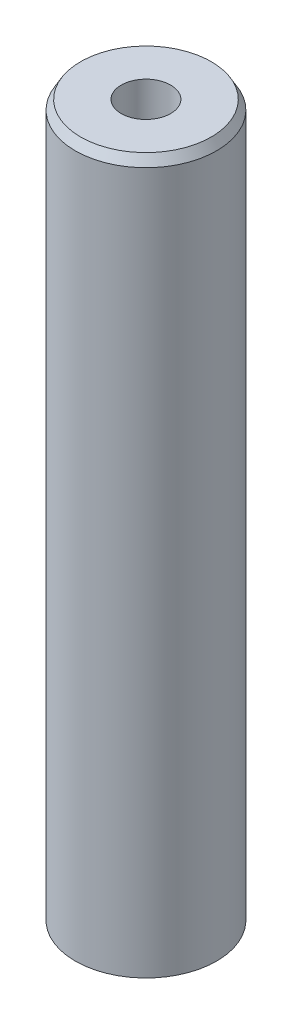
ISO-10303-21;
HEADER;
FILE_DESCRIPTION(('STEP AP214'),'2;1');
FILE_NAME('part.step','',(''),(''),'','','');
FILE_SCHEMA(('AUTOMOTIVE_DESIGN { 1 0 10303 214 1 1 1 1 }'));
ENDSEC;
DATA;
#1=APPLICATION_CONTEXT('core data for automotive mechanical design processes');
#2=APPLICATION_PROTOCOL_DEFINITION('international standard','automotive_design',2000,#1);
#3=PRODUCT_CONTEXT('',#1,'mechanical');
#4=PRODUCT('Part','Part','',(#3));
#5=PRODUCT_RELATED_PRODUCT_CATEGORY('part','',(#4));
#6=PRODUCT_DEFINITION_FORMATION('','',#4);
#7=PRODUCT_DEFINITION_CONTEXT('part definition',#1,'design');
#8=PRODUCT_DEFINITION('design','',#6,#7);
#9=PRODUCT_DEFINITION_SHAPE('','',#8);
#10=(LENGTH_UNIT() NAMED_UNIT(*) SI_UNIT(.MILLI.,.METRE.));
#11=(NAMED_UNIT(*) PLANE_ANGLE_UNIT() SI_UNIT($,.RADIAN.));
#12=(NAMED_UNIT(*) SI_UNIT($,.STERADIAN.) SOLID_ANGLE_UNIT());
#13=UNCERTAINTY_MEASURE_WITH_UNIT(LENGTH_MEASURE(1.E-05),#10,'distance_accuracy_value','');
#14=(GEOMETRIC_REPRESENTATION_CONTEXT(3) GLOBAL_UNCERTAINTY_ASSIGNED_CONTEXT((#13)) GLOBAL_UNIT_ASSIGNED_CONTEXT((#10,
#11,#12)) REPRESENTATION_CONTEXT('',''));
#15=CARTESIAN_POINT('',(0.,0.,0.));
#16=DIRECTION('',(0.,0.,1.));
#17=DIRECTION('',(1.,0.,0.));
#18=AXIS2_PLACEMENT_3D('',#15,#16,#17);
#19=CARTESIAN_POINT('',(0.,278.762209575385,0.));
#20=DIRECTION('',(0.,-1.,0.));
#21=DIRECTION('',(0.,0.,-1.));
#22=AXIS2_PLACEMENT_3D('',#19,#20,#21);
#23=CYLINDRICAL_SURFACE('',#22,27.5);
#24=CARTESIAN_POINT('',(0.,275.14791958401,0.));
#25=DIRECTION('',(0.,1.,0.));
#26=DIRECTION('',(0.,0.,1.));
#27=AXIS2_PLACEMENT_3D('',#24,#25,#26);
#28=CIRCLE('',#27,27.5);
#29=CARTESIAN_POINT('',(0.,275.14791958401,27.5));
#30=VERTEX_POINT('',#29);
#31=EDGE_CURVE('E50',#30,#30,#28,.F.);
#32=ORIENTED_EDGE('',*,*,#31,.T.);
#33=EDGE_LOOP('',(#32));
#34=FACE_BOUND('',#33,.T.);
#35=CARTESIAN_POINT('',(0.,2.08671129944965,0.));
#36=DIRECTION('',(0.,1.,0.));
#37=DIRECTION('',(0.,0.,1.));
#38=AXIS2_PLACEMENT_3D('',#35,#36,#37);
#39=CIRCLE('',#38,27.5);
#40=CARTESIAN_POINT('',(0.,2.08671129944965,27.5));
#41=VERTEX_POINT('',#40);
#42=EDGE_CURVE('E51',#41,#41,#39,.T.);
#43=ORIENTED_EDGE('',*,*,#42,.T.);
#44=EDGE_LOOP('',(#43));
#45=FACE_BOUND('',#44,.T.);
#46=ADVANCED_FACE('F39',(#34,#45),#23,.T.);
#47=CARTESIAN_POINT('',(0.,278.762209575385,0.));
#48=DIRECTION('',(0.,1.,0.));
#49=DIRECTION('',(0.,0.,1.));
#50=AXIS2_PLACEMENT_3D('',#47,#48,#49);
#51=PLANE('',#50);
#52=CARTESIAN_POINT('',(0.,278.762209575385,0.));
#53=DIRECTION('',(0.,1.,0.));
#54=DIRECTION('',(0.,0.,1.));
#55=AXIS2_PLACEMENT_3D('',#52,#53,#54);
#56=CIRCLE('',#55,25.4132887005504);
#57=CARTESIAN_POINT('',(0.,278.762209575385,25.4132887005504));
#58=VERTEX_POINT('',#57);
#59=EDGE_CURVE('E54',#58,#58,#56,.T.);
#60=ORIENTED_EDGE('',*,*,#59,.T.);
#61=EDGE_LOOP('',(#60));
#62=FACE_BOUND('',#61,.T.);
#63=CARTESIAN_POINT('',(0.,278.762209575385,0.));
#64=DIRECTION('',(0.,1.,0.));
#65=DIRECTION('',(0.,0.,1.));
#66=AXIS2_PLACEMENT_3D('',#63,#64,#65);
#67=CIRCLE('',#66,9.62264124655303);
#68=CARTESIAN_POINT('',(0.,278.762209575385,9.62264124655303));
#69=VERTEX_POINT('',#68);
#70=EDGE_CURVE('E58',#69,#69,#67,.T.);
#71=ORIENTED_EDGE('',*,*,#70,.F.);
#72=EDGE_LOOP('',(#71));
#73=FACE_BOUND('',#72,.T.);
#74=ADVANCED_FACE('F69',(#62,#73),#51,.T.);
#75=CARTESIAN_POINT('',(0.,0.,0.));
#76=DIRECTION('',(0.,1.,0.));
#77=DIRECTION('',(0.,0.,1.));
#78=AXIS2_PLACEMENT_3D('',#75,#76,#77);
#79=PLANE('',#78);
#80=CARTESIAN_POINT('',(0.,0.,0.));
#81=DIRECTION('',(0.,1.,0.));
#82=DIRECTION('',(0.,0.,1.));
#83=AXIS2_PLACEMENT_3D('',#80,#81,#82);
#84=CIRCLE('',#83,23.8857100086252);
#85=CARTESIAN_POINT('',(0.,0.,23.8857100086252));
#86=VERTEX_POINT('',#85);
#87=EDGE_CURVE('E10',#86,#86,#84,.F.);
#88=ORIENTED_EDGE('',*,*,#87,.T.);
#89=EDGE_LOOP('',(#88));
#90=FACE_BOUND('',#89,.T.);
#91=CARTESIAN_POINT('',(0.,0.,0.));
#92=DIRECTION('',(0.,1.,0.));
#93=DIRECTION('',(0.,0.,1.));
#94=AXIS2_PLACEMENT_3D('',#91,#92,#93);
#95=CIRCLE('',#94,9.62264124655303);
#96=CARTESIAN_POINT('',(0.,0.,9.62264124655303));
#97=VERTEX_POINT('',#96);
#98=EDGE_CURVE('E63',#97,#97,#95,.T.);
#99=ORIENTED_EDGE('',*,*,#98,.T.);
#100=EDGE_LOOP('',(#99));
#101=FACE_BOUND('',#100,.T.);
#102=ADVANCED_FACE('F75',(#90,#101),#79,.F.);
#103=CARTESIAN_POINT('',(0.,278.762209575385,0.));
#104=DIRECTION('',(0.,-1.,0.));
#105=DIRECTION('',(0.,0.,-1.));
#106=AXIS2_PLACEMENT_3D('',#103,#104,#105);
#107=CYLINDRICAL_SURFACE('',#106,9.62264124655303);
#108=ORIENTED_EDGE('',*,*,#70,.T.);
#109=EDGE_LOOP('',(#108));
#110=FACE_BOUND('',#109,.T.);
#111=ORIENTED_EDGE('',*,*,#98,.F.);
#112=EDGE_LOOP('',(#111));
#113=FACE_BOUND('',#112,.T.);
#114=ADVANCED_FACE('F70',(#110,#113),#107,.F.);
#115=CARTESIAN_POINT('',(0.,278.762209575385,0.));
#116=DIRECTION('',(0.,-1.,0.));
#117=DIRECTION('',(0.,0.,-1.));
#118=AXIS2_PLACEMENT_3D('',#115,#116,#117);
#119=CONICAL_SURFACE('',#118,25.4132887005504,0.523598775598295);
#120=ORIENTED_EDGE('',*,*,#31,.F.);
#121=EDGE_LOOP('',(#120));
#122=FACE_BOUND('',#121,.T.);
#123=ORIENTED_EDGE('',*,*,#59,.F.);
#124=EDGE_LOOP('',(#123));
#125=FACE_BOUND('',#124,.T.);
#126=ADVANCED_FACE('F81',(#122,#125),#119,.T.);
#127=CARTESIAN_POINT('',(0.,2.08671129944965,0.));
#128=DIRECTION('',(0.,1.,0.));
#129=DIRECTION('',(0.,0.,1.));
#130=AXIS2_PLACEMENT_3D('',#127,#128,#129);
#131=CONICAL_SURFACE('',#130,27.5,1.04719755119659);
#132=ORIENTED_EDGE('',*,*,#87,.F.);
#133=EDGE_LOOP('',(#132));
#134=FACE_BOUND('',#133,.T.);
#135=ORIENTED_EDGE('',*,*,#42,.F.);
#136=EDGE_LOOP('',(#135));
#137=FACE_BOUND('',#136,.T.);
#138=ADVANCED_FACE('F45',(#134,#137),#131,.T.);
#139=CLOSED_SHELL('',(#46,#74,#102,#114,#126,#138));
#140=MANIFOLD_SOLID_BREP('B2',#139);
#141=ADVANCED_BREP_SHAPE_REPRESENTATION('',(#18,#140),#14);
#142=SHAPE_DEFINITION_REPRESENTATION(#9,#141);
ENDSEC;
END-ISO-10303-21;
